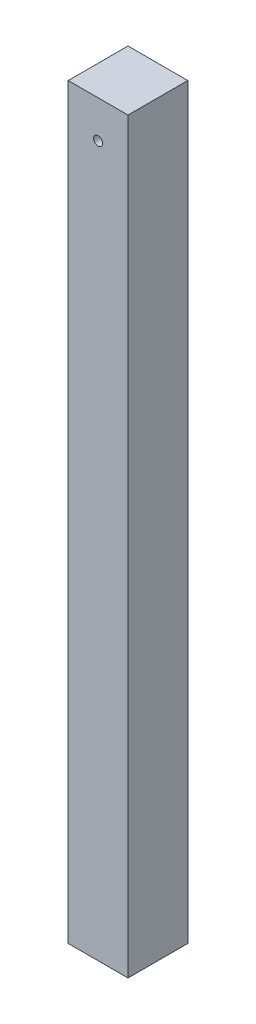
ISO-10303-21;
HEADER;
FILE_DESCRIPTION(('STEP AP214'),'2;1');
FILE_NAME('part.step','',(''),(''),'','','');
FILE_SCHEMA(('AUTOMOTIVE_DESIGN { 1 0 10303 214 1 1 1 1 }'));
ENDSEC;
DATA;
#1=APPLICATION_CONTEXT('core data for automotive mechanical design processes');
#2=APPLICATION_PROTOCOL_DEFINITION('international standard','automotive_design',2000,#1);
#3=PRODUCT_CONTEXT('',#1,'mechanical');
#4=PRODUCT('Part','Part','',(#3));
#5=PRODUCT_RELATED_PRODUCT_CATEGORY('part','',(#4));
#6=PRODUCT_DEFINITION_FORMATION('','',#4);
#7=PRODUCT_DEFINITION_CONTEXT('part definition',#1,'design');
#8=PRODUCT_DEFINITION('design','',#6,#7);
#9=PRODUCT_DEFINITION_SHAPE('','',#8);
#10=(LENGTH_UNIT() NAMED_UNIT(*) SI_UNIT(.MILLI.,.METRE.));
#11=(NAMED_UNIT(*) PLANE_ANGLE_UNIT() SI_UNIT($,.RADIAN.));
#12=(NAMED_UNIT(*) SI_UNIT($,.STERADIAN.) SOLID_ANGLE_UNIT());
#13=UNCERTAINTY_MEASURE_WITH_UNIT(LENGTH_MEASURE(1.E-05),#10,'distance_accuracy_value','');
#14=(GEOMETRIC_REPRESENTATION_CONTEXT(3) GLOBAL_UNCERTAINTY_ASSIGNED_CONTEXT((#13)) GLOBAL_UNIT_ASSIGNED_CONTEXT((#10,
#11,#12)) REPRESENTATION_CONTEXT('',''));
#15=CARTESIAN_POINT('',(0.,0.,0.));
#16=DIRECTION('',(0.,0.,1.));
#17=DIRECTION('',(1.,0.,0.));
#18=AXIS2_PLACEMENT_3D('',#15,#16,#17);
#19=CARTESIAN_POINT('',(40.,-500.,-80.));
#20=DIRECTION('',(1.,0.,0.));
#21=DIRECTION('',(0.,0.,-1.));
#22=AXIS2_PLACEMENT_3D('',#19,#20,#21);
#23=PLANE('',#22);
#24=DIRECTION('',(0.,1.,0.));
#25=VECTOR('',#24,1.);
#26=CARTESIAN_POINT('',(40.,-500.,0.));
#27=LINE('',#26,#25);
#28=CARTESIAN_POINT('',(40.,-500.,0.));
#29=VERTEX_POINT('',#28);
#30=CARTESIAN_POINT('',(40.,500.,0.));
#31=VERTEX_POINT('',#30);
#32=EDGE_CURVE('E98',#29,#31,#27,.T.);
#33=ORIENTED_EDGE('',*,*,#32,.F.);
#34=DIRECTION('',(0.,0.,1.));
#35=VECTOR('',#34,1.);
#36=CARTESIAN_POINT('',(40.,-500.,-80.));
#37=LINE('',#36,#35);
#38=CARTESIAN_POINT('',(40.,-500.,-80.));
#39=VERTEX_POINT('',#38);
#40=EDGE_CURVE('E11',#39,#29,#37,.T.);
#41=ORIENTED_EDGE('',*,*,#40,.F.);
#42=DIRECTION('',(0.,1.,0.));
#43=VECTOR('',#42,1.);
#44=CARTESIAN_POINT('',(40.,-500.,-80.));
#45=LINE('',#44,#43);
#46=CARTESIAN_POINT('',(40.,500.,-80.));
#47=VERTEX_POINT('',#46);
#48=EDGE_CURVE('E91',#39,#47,#45,.T.);
#49=ORIENTED_EDGE('',*,*,#48,.T.);
#50=DIRECTION('',(0.,0.,1.));
#51=VECTOR('',#50,1.);
#52=CARTESIAN_POINT('',(40.,500.,-80.));
#53=LINE('',#52,#51);
#54=EDGE_CURVE('E36',#47,#31,#53,.T.);
#55=ORIENTED_EDGE('',*,*,#54,.T.);
#56=EDGE_LOOP('',(#33,#41,#49,#55));
#57=FACE_BOUND('',#56,.T.);
#58=ADVANCED_FACE('F33',(#57),#23,.T.);
#59=CARTESIAN_POINT('',(-40.,-500.,-80.));
#60=DIRECTION('',(0.,-1.,0.));
#61=DIRECTION('',(0.,0.,-1.));
#62=AXIS2_PLACEMENT_3D('',#59,#60,#61);
#63=PLANE('',#62);
#64=DIRECTION('',(1.,0.,0.));
#65=VECTOR('',#64,1.);
#66=CARTESIAN_POINT('',(-40.,-500.,0.));
#67=LINE('',#66,#65);
#68=CARTESIAN_POINT('',(-40.,-500.,0.));
#69=VERTEX_POINT('',#68);
#70=EDGE_CURVE('E93',#69,#29,#67,.T.);
#71=ORIENTED_EDGE('',*,*,#70,.F.);
#72=DIRECTION('',(0.,0.,1.));
#73=VECTOR('',#72,1.);
#74=CARTESIAN_POINT('',(-40.,-500.,-80.));
#75=LINE('',#74,#73);
#76=CARTESIAN_POINT('',(-40.,-500.,-80.));
#77=VERTEX_POINT('',#76);
#78=EDGE_CURVE('E42',#77,#69,#75,.T.);
#79=ORIENTED_EDGE('',*,*,#78,.F.);
#80=DIRECTION('',(1.,0.,0.));
#81=VECTOR('',#80,1.);
#82=CARTESIAN_POINT('',(-40.,-500.,-80.));
#83=LINE('',#82,#81);
#84=EDGE_CURVE('E88',#77,#39,#83,.T.);
#85=ORIENTED_EDGE('',*,*,#84,.T.);
#86=ORIENTED_EDGE('',*,*,#40,.T.);
#87=EDGE_LOOP('',(#71,#79,#85,#86));
#88=FACE_BOUND('',#87,.T.);
#89=ADVANCED_FACE('F109',(#88),#63,.T.);
#90=CARTESIAN_POINT('',(-40.,-500.,-80.));
#91=DIRECTION('',(-1.,0.,0.));
#92=DIRECTION('',(0.,0.,1.));
#93=AXIS2_PLACEMENT_3D('',#90,#91,#92);
#94=PLANE('',#93);
#95=DIRECTION('',(0.,-1.,0.));
#96=VECTOR('',#95,1.);
#97=CARTESIAN_POINT('',(-40.,-500.,0.));
#98=LINE('',#97,#96);
#99=CARTESIAN_POINT('',(-40.,500.,0.));
#100=VERTEX_POINT('',#99);
#101=EDGE_CURVE('E83',#100,#69,#98,.T.);
#102=ORIENTED_EDGE('',*,*,#101,.F.);
#103=DIRECTION('',(0.,0.,1.));
#104=VECTOR('',#103,1.);
#105=CARTESIAN_POINT('',(-40.,500.,-80.));
#106=LINE('',#105,#104);
#107=CARTESIAN_POINT('',(-40.,500.,-80.));
#108=VERTEX_POINT('',#107);
#109=EDGE_CURVE('E78',#108,#100,#106,.T.);
#110=ORIENTED_EDGE('',*,*,#109,.F.);
#111=DIRECTION('',(0.,-1.,0.));
#112=VECTOR('',#111,1.);
#113=CARTESIAN_POINT('',(-40.,-500.,-80.));
#114=LINE('',#113,#112);
#115=EDGE_CURVE('E81',#108,#77,#114,.T.);
#116=ORIENTED_EDGE('',*,*,#115,.T.);
#117=ORIENTED_EDGE('',*,*,#78,.T.);
#118=EDGE_LOOP('',(#102,#110,#116,#117));
#119=FACE_BOUND('',#118,.T.);
#120=ADVANCED_FACE('F80',(#119),#94,.T.);
#121=CARTESIAN_POINT('',(-40.,500.,-80.));
#122=DIRECTION('',(0.,1.,0.));
#123=DIRECTION('',(0.,0.,1.));
#124=AXIS2_PLACEMENT_3D('',#121,#122,#123);
#125=PLANE('',#124);
#126=DIRECTION('',(-1.,0.,0.));
#127=VECTOR('',#126,1.);
#128=CARTESIAN_POINT('',(-40.,500.,0.));
#129=LINE('',#128,#127);
#130=EDGE_CURVE('E101',#31,#100,#129,.T.);
#131=ORIENTED_EDGE('',*,*,#130,.F.);
#132=ORIENTED_EDGE('',*,*,#54,.F.);
#133=DIRECTION('',(-1.,0.,0.));
#134=VECTOR('',#133,1.);
#135=CARTESIAN_POINT('',(-40.,500.,-80.));
#136=LINE('',#135,#134);
#137=EDGE_CURVE('E87',#47,#108,#136,.T.);
#138=ORIENTED_EDGE('',*,*,#137,.T.);
#139=ORIENTED_EDGE('',*,*,#109,.T.);
#140=EDGE_LOOP('',(#131,#132,#138,#139));
#141=FACE_BOUND('',#140,.T.);
#142=ADVANCED_FACE('F90',(#141),#125,.T.);
#143=CARTESIAN_POINT('',(0.,0.,-80.));
#144=DIRECTION('',(0.,0.,-1.));
#145=DIRECTION('',(-1.,0.,0.));
#146=AXIS2_PLACEMENT_3D('',#143,#144,#145);
#147=PLANE('',#146);
#148=CARTESIAN_POINT('',(0.,450.,-80.));
#149=DIRECTION('',(0.,0.,-1.));
#150=DIRECTION('',(-1.,0.,0.));
#151=AXIS2_PLACEMENT_3D('',#148,#149,#150);
#152=CIRCLE('',#151,6.);
#153=CARTESIAN_POINT('',(-6.00000000000002,450.,-80.));
#154=VERTEX_POINT('',#153);
#155=EDGE_CURVE('E138',#154,#154,#152,.F.);
#156=ORIENTED_EDGE('',*,*,#155,.T.);
#157=EDGE_LOOP('',(#156));
#158=FACE_BOUND('',#157,.T.);
#159=ORIENTED_EDGE('',*,*,#48,.F.);
#160=ORIENTED_EDGE('',*,*,#84,.F.);
#161=ORIENTED_EDGE('',*,*,#115,.F.);
#162=ORIENTED_EDGE('',*,*,#137,.F.);
#163=EDGE_LOOP('',(#159,#160,#161,#162));
#164=FACE_BOUND('',#163,.T.);
#165=ADVANCED_FACE('F86',(#158,#164),#147,.T.);
#166=CARTESIAN_POINT('',(0.,0.,0.));
#167=DIRECTION('',(0.,0.,-1.));
#168=DIRECTION('',(-1.,0.,0.));
#169=AXIS2_PLACEMENT_3D('',#166,#167,#168);
#170=PLANE('',#169);
#171=CARTESIAN_POINT('',(0.,450.,0.));
#172=DIRECTION('',(0.,0.,1.));
#173=DIRECTION('',(1.,0.,0.));
#174=AXIS2_PLACEMENT_3D('',#171,#172,#173);
#175=CIRCLE('',#174,6.);
#176=CARTESIAN_POINT('',(5.99999999999999,450.,0.));
#177=VERTEX_POINT('',#176);
#178=EDGE_CURVE('E102',#177,#177,#175,.T.);
#179=ORIENTED_EDGE('',*,*,#178,.F.);
#180=EDGE_LOOP('',(#179));
#181=FACE_BOUND('',#180,.T.);
#182=ORIENTED_EDGE('',*,*,#32,.T.);
#183=ORIENTED_EDGE('',*,*,#130,.T.);
#184=ORIENTED_EDGE('',*,*,#101,.T.);
#185=ORIENTED_EDGE('',*,*,#70,.T.);
#186=EDGE_LOOP('',(#182,#183,#184,#185));
#187=FACE_BOUND('',#186,.T.);
#188=ADVANCED_FACE('F108',(#181,#187),#170,.F.);
#189=CARTESIAN_POINT('',(0.,450.,-80.001));
#190=DIRECTION('',(0.,0.,1.));
#191=DIRECTION('',(1.,0.,0.));
#192=AXIS2_PLACEMENT_3D('',#189,#190,#191);
#193=CYLINDRICAL_SURFACE('',#192,6.);
#194=ORIENTED_EDGE('',*,*,#155,.F.);
#195=EDGE_LOOP('',(#194));
#196=FACE_BOUND('',#195,.T.);
#197=ORIENTED_EDGE('',*,*,#178,.T.);
#198=EDGE_LOOP('',(#197));
#199=FACE_BOUND('',#198,.T.);
#200=ADVANCED_FACE('F127',(#196,#199),#193,.F.);
#201=CLOSED_SHELL('',(#58,#89,#120,#142,#165,#188,#200));
#202=MANIFOLD_SOLID_BREP('B2',#201);
#203=ADVANCED_BREP_SHAPE_REPRESENTATION('',(#18,#202),#14);
#204=SHAPE_DEFINITION_REPRESENTATION(#9,#203);
ENDSEC;
END-ISO-10303-21;
